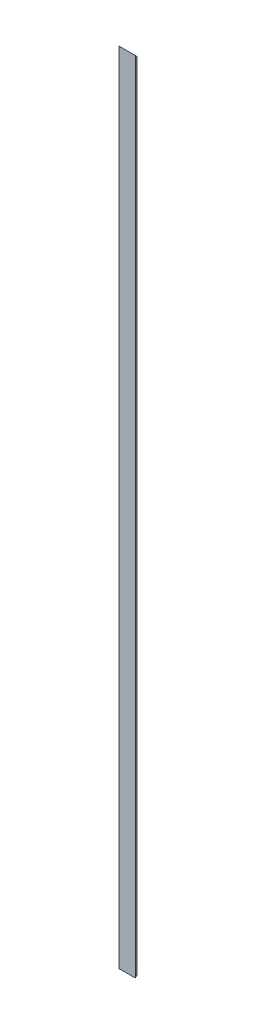
ISO-10303-21;
HEADER;
FILE_DESCRIPTION(('STEP AP214'),'2;1');
FILE_NAME('part.step','',(''),(''),'','','');
FILE_SCHEMA(('AUTOMOTIVE_DESIGN { 1 0 10303 214 1 1 1 1 }'));
ENDSEC;
DATA;
#1=APPLICATION_CONTEXT('core data for automotive mechanical design processes');
#2=APPLICATION_PROTOCOL_DEFINITION('international standard','automotive_design',2000,#1);
#3=PRODUCT_CONTEXT('',#1,'mechanical');
#4=PRODUCT('Part','Part','',(#3));
#5=PRODUCT_RELATED_PRODUCT_CATEGORY('part','',(#4));
#6=PRODUCT_DEFINITION_FORMATION('','',#4);
#7=PRODUCT_DEFINITION_CONTEXT('part definition',#1,'design');
#8=PRODUCT_DEFINITION('design','',#6,#7);
#9=PRODUCT_DEFINITION_SHAPE('','',#8);
#10=(LENGTH_UNIT() NAMED_UNIT(*) SI_UNIT(.MILLI.,.METRE.));
#11=(NAMED_UNIT(*) PLANE_ANGLE_UNIT() SI_UNIT($,.RADIAN.));
#12=(NAMED_UNIT(*) SI_UNIT($,.STERADIAN.) SOLID_ANGLE_UNIT());
#13=UNCERTAINTY_MEASURE_WITH_UNIT(LENGTH_MEASURE(1.E-05),#10,'distance_accuracy_value','');
#14=(GEOMETRIC_REPRESENTATION_CONTEXT(3) GLOBAL_UNCERTAINTY_ASSIGNED_CONTEXT((#13)) GLOBAL_UNIT_ASSIGNED_CONTEXT((#10,
#11,#12)) REPRESENTATION_CONTEXT('',''));
#15=CARTESIAN_POINT('',(0.,0.,0.));
#16=DIRECTION('',(0.,0.,1.));
#17=DIRECTION('',(1.,0.,0.));
#18=AXIS2_PLACEMENT_3D('',#15,#16,#17);
#19=CARTESIAN_POINT('',(0.,2200.,0.));
#20=DIRECTION('',(0.,0.,-1.));
#21=DIRECTION('',(-1.,0.,0.));
#22=AXIS2_PLACEMENT_3D('',#19,#20,#21);
#23=PLANE('',#22);
#24=DIRECTION('',(1.,0.,0.));
#25=VECTOR('',#24,1.);
#26=CARTESIAN_POINT('',(0.,0.,0.));
#27=LINE('',#26,#25);
#28=CARTESIAN_POINT('',(0.,0.,0.));
#29=VERTEX_POINT('',#28);
#30=CARTESIAN_POINT('',(45.,0.,0.));
#31=VERTEX_POINT('',#30);
#32=EDGE_CURVE('E97',#29,#31,#27,.T.);
#33=ORIENTED_EDGE('',*,*,#32,.T.);
#34=DIRECTION('',(0.,-1.,0.));
#35=VECTOR('',#34,1.);
#36=CARTESIAN_POINT('',(45.,2200.,0.));
#37=LINE('',#36,#35);
#38=CARTESIAN_POINT('',(45.,2200.,0.));
#39=VERTEX_POINT('',#38);
#40=EDGE_CURVE('E11',#39,#31,#37,.T.);
#41=ORIENTED_EDGE('',*,*,#40,.F.);
#42=DIRECTION('',(1.,0.,0.));
#43=VECTOR('',#42,1.);
#44=CARTESIAN_POINT('',(0.,2200.,0.));
#45=LINE('',#44,#43);
#46=CARTESIAN_POINT('',(0.,2200.,0.));
#47=VERTEX_POINT('',#46);
#48=EDGE_CURVE('E108',#47,#39,#45,.T.);
#49=ORIENTED_EDGE('',*,*,#48,.F.);
#50=DIRECTION('',(0.,-1.,0.));
#51=VECTOR('',#50,1.);
#52=CARTESIAN_POINT('',(0.,2200.,0.));
#53=LINE('',#52,#51);
#54=EDGE_CURVE('E114',#47,#29,#53,.T.);
#55=ORIENTED_EDGE('',*,*,#54,.T.);
#56=EDGE_LOOP('',(#33,#41,#49,#55));
#57=FACE_BOUND('',#56,.T.);
#58=ADVANCED_FACE('F38',(#57),#23,.F.);
#59=CARTESIAN_POINT('',(45.,2200.,-5.));
#60=DIRECTION('',(1.,0.,0.));
#61=DIRECTION('',(0.,0.,-1.));
#62=AXIS2_PLACEMENT_3D('',#59,#60,#61);
#63=PLANE('',#62);
#64=DIRECTION('',(0.,0.707106781186543,-0.707106781186552));
#65=VECTOR('',#64,1.);
#66=CARTESIAN_POINT('',(45.,0.,0.));
#67=LINE('',#66,#65);
#68=CARTESIAN_POINT('',(45.,4.99999999999999,-5.00000000000008));
#69=VERTEX_POINT('',#68);
#70=EDGE_CURVE('E103',#31,#69,#67,.T.);
#71=ORIENTED_EDGE('',*,*,#70,.T.);
#72=DIRECTION('',(0.,-1.,0.));
#73=VECTOR('',#72,1.);
#74=CARTESIAN_POINT('',(45.,2200.,-5.));
#75=LINE('',#74,#73);
#76=CARTESIAN_POINT('',(45.,2195.,-5.));
#77=VERTEX_POINT('',#76);
#78=EDGE_CURVE('E47',#77,#69,#75,.T.);
#79=ORIENTED_EDGE('',*,*,#78,.F.);
#80=DIRECTION('',(0.,0.707106781186543,0.707106781186552));
#81=VECTOR('',#80,1.);
#82=CARTESIAN_POINT('',(45.,2200.,0.));
#83=LINE('',#82,#81);
#84=EDGE_CURVE('E147',#77,#39,#83,.T.);
#85=ORIENTED_EDGE('',*,*,#84,.T.);
#86=ORIENTED_EDGE('',*,*,#40,.T.);
#87=EDGE_LOOP('',(#71,#79,#85,#86));
#88=FACE_BOUND('',#87,.T.);
#89=ADVANCED_FACE('F146',(#88),#63,.T.);
#90=CARTESIAN_POINT('',(0.,2200.,-5.));
#91=DIRECTION('',(0.,0.,-1.));
#92=DIRECTION('',(-1.,0.,0.));
#93=AXIS2_PLACEMENT_3D('',#90,#91,#92);
#94=PLANE('',#93);
#95=DIRECTION('',(1.,0.,0.));
#96=VECTOR('',#95,1.);
#97=CARTESIAN_POINT('',(0.,4.99999999999989,-5.));
#98=LINE('',#97,#96);
#99=CARTESIAN_POINT('',(5.,4.99999999999989,-4.99999999999989));
#100=VERTEX_POINT('',#99);
#101=EDGE_CURVE('E143',#100,#69,#98,.T.);
#102=ORIENTED_EDGE('',*,*,#101,.F.);
#103=DIRECTION('',(0.,-1.,0.));
#104=VECTOR('',#103,1.);
#105=CARTESIAN_POINT('',(5.,2200.,-5.));
#106=LINE('',#105,#104);
#107=CARTESIAN_POINT('',(5.,2195.,-5.));
#108=VERTEX_POINT('',#107);
#109=EDGE_CURVE('E132',#108,#100,#106,.T.);
#110=ORIENTED_EDGE('',*,*,#109,.F.);
#111=DIRECTION('',(-1.,0.,0.));
#112=VECTOR('',#111,1.);
#113=CARTESIAN_POINT('',(0.,2195.,-5.));
#114=LINE('',#113,#112);
#115=EDGE_CURVE('E109',#77,#108,#114,.T.);
#116=ORIENTED_EDGE('',*,*,#115,.F.);
#117=ORIENTED_EDGE('',*,*,#78,.T.);
#118=EDGE_LOOP('',(#102,#110,#116,#117));
#119=FACE_BOUND('',#118,.T.);
#120=ADVANCED_FACE('F141',(#119),#94,.T.);
#121=CARTESIAN_POINT('',(5.,2200.,-45.));
#122=DIRECTION('',(1.,0.,0.));
#123=DIRECTION('',(0.,0.,-1.));
#124=AXIS2_PLACEMENT_3D('',#121,#122,#123);
#125=PLANE('',#124);
#126=DIRECTION('',(0.,-0.707106781186544,0.707106781186552));
#127=VECTOR('',#126,1.);
#128=CARTESIAN_POINT('',(4.99999999999996,1122.49999999999,-1122.5));
#129=LINE('',#128,#127);
#130=CARTESIAN_POINT('',(5.00000000000001,44.9999999999995,-45.));
#131=VERTEX_POINT('',#130);
#132=EDGE_CURVE('E152',#131,#100,#129,.T.);
#133=ORIENTED_EDGE('',*,*,#132,.F.);
#134=DIRECTION('',(0.,-1.,0.));
#135=VECTOR('',#134,1.);
#136=CARTESIAN_POINT('',(5.,2200.,-45.));
#137=LINE('',#136,#135);
#138=CARTESIAN_POINT('',(5.00000000000001,2155.,-45.));
#139=VERTEX_POINT('',#138);
#140=EDGE_CURVE('E125',#139,#131,#137,.T.);
#141=ORIENTED_EDGE('',*,*,#140,.F.);
#142=DIRECTION('',(0.,-0.707106781186544,-0.707106781186552));
#143=VECTOR('',#142,1.);
#144=CARTESIAN_POINT('',(5.,2177.5,-22.5000000000003));
#145=LINE('',#144,#143);
#146=EDGE_CURVE('E165',#108,#139,#145,.T.);
#147=ORIENTED_EDGE('',*,*,#146,.F.);
#148=ORIENTED_EDGE('',*,*,#109,.T.);
#149=EDGE_LOOP('',(#133,#141,#147,#148));
#150=FACE_BOUND('',#149,.T.);
#151=ADVANCED_FACE('F175',(#150),#125,.T.);
#152=CARTESIAN_POINT('',(0.,2200.,-45.));
#153=DIRECTION('',(0.,0.,-1.));
#154=DIRECTION('',(-1.,0.,0.));
#155=AXIS2_PLACEMENT_3D('',#152,#153,#154);
#156=PLANE('',#155);
#157=DIRECTION('',(-1.,0.,0.));
#158=VECTOR('',#157,1.);
#159=CARTESIAN_POINT('',(45.,44.9999999999995,-45.));
#160=LINE('',#159,#158);
#161=CARTESIAN_POINT('',(0.,44.9999999999995,-45.));
#162=VERTEX_POINT('',#161);
#163=EDGE_CURVE('E149',#131,#162,#160,.T.);
#164=ORIENTED_EDGE('',*,*,#163,.T.);
#165=DIRECTION('',(0.,-1.,0.));
#166=VECTOR('',#165,1.);
#167=CARTESIAN_POINT('',(0.,2200.,-45.));
#168=LINE('',#167,#166);
#169=CARTESIAN_POINT('',(0.,2155.,-45.));
#170=VERTEX_POINT('',#169);
#171=EDGE_CURVE('E117',#170,#162,#168,.T.);
#172=ORIENTED_EDGE('',*,*,#171,.F.);
#173=DIRECTION('',(-1.,0.,0.));
#174=VECTOR('',#173,1.);
#175=CARTESIAN_POINT('',(45.,2155.,-45.));
#176=LINE('',#175,#174);
#177=EDGE_CURVE('E119',#139,#170,#176,.T.);
#178=ORIENTED_EDGE('',*,*,#177,.F.);
#179=ORIENTED_EDGE('',*,*,#140,.T.);
#180=EDGE_LOOP('',(#164,#172,#178,#179));
#181=FACE_BOUND('',#180,.T.);
#182=ADVANCED_FACE('F177',(#181),#156,.T.);
#183=CARTESIAN_POINT('',(0.,2200.,-45.));
#184=DIRECTION('',(1.,0.,0.));
#185=DIRECTION('',(0.,0.,-1.));
#186=AXIS2_PLACEMENT_3D('',#183,#184,#185);
#187=PLANE('',#186);
#188=ORIENTED_EDGE('',*,*,#171,.T.);
#189=DIRECTION('',(0.,0.707106781186543,-0.707106781186552));
#190=VECTOR('',#189,1.);
#191=CARTESIAN_POINT('',(0.,0.,0.));
#192=LINE('',#191,#190);
#193=EDGE_CURVE('E100',#29,#162,#192,.T.);
#194=ORIENTED_EDGE('',*,*,#193,.F.);
#195=ORIENTED_EDGE('',*,*,#54,.F.);
#196=DIRECTION('',(0.,0.707106781186543,0.707106781186552));
#197=VECTOR('',#196,1.);
#198=CARTESIAN_POINT('',(0.,2200.,0.));
#199=LINE('',#198,#197);
#200=EDGE_CURVE('E56',#170,#47,#199,.T.);
#201=ORIENTED_EDGE('',*,*,#200,.F.);
#202=EDGE_LOOP('',(#188,#194,#195,#201));
#203=FACE_BOUND('',#202,.T.);
#204=ADVANCED_FACE('F113',(#203),#187,.F.);
#205=CARTESIAN_POINT('',(45.,0.,0.));
#206=DIRECTION('',(0.,0.707106781186551,0.707106781186543));
#207=DIRECTION('',(0.,-0.707106781186544,0.707106781186552));
#208=AXIS2_PLACEMENT_3D('',#205,#206,#207);
#209=PLANE('',#208);
#210=ORIENTED_EDGE('',*,*,#101,.T.);
#211=ORIENTED_EDGE('',*,*,#70,.F.);
#212=ORIENTED_EDGE('',*,*,#32,.F.);
#213=ORIENTED_EDGE('',*,*,#193,.T.);
#214=ORIENTED_EDGE('',*,*,#163,.F.);
#215=ORIENTED_EDGE('',*,*,#132,.T.);
#216=EDGE_LOOP('',(#210,#211,#212,#213,#214,#215));
#217=FACE_BOUND('',#216,.T.);
#218=ADVANCED_FACE('F99',(#217),#209,.F.);
#219=CARTESIAN_POINT('',(45.,2200.,0.));
#220=DIRECTION('',(0.,-0.707106781186551,0.707106781186543));
#221=DIRECTION('',(0.,-0.707106781186544,-0.707106781186552));
#222=AXIS2_PLACEMENT_3D('',#219,#220,#221);
#223=PLANE('',#222);
#224=ORIENTED_EDGE('',*,*,#115,.T.);
#225=ORIENTED_EDGE('',*,*,#146,.T.);
#226=ORIENTED_EDGE('',*,*,#177,.T.);
#227=ORIENTED_EDGE('',*,*,#200,.T.);
#228=ORIENTED_EDGE('',*,*,#48,.T.);
#229=ORIENTED_EDGE('',*,*,#84,.F.);
#230=EDGE_LOOP('',(#224,#225,#226,#227,#228,#229));
#231=FACE_BOUND('',#230,.T.);
#232=ADVANCED_FACE('F170',(#231),#223,.F.);
#233=CLOSED_SHELL('',(#58,#89,#120,#151,#182,#204,#218,#232));
#234=MANIFOLD_SOLID_BREP('B2',#233);
#235=ADVANCED_BREP_SHAPE_REPRESENTATION('',(#18,#234),#14);
#236=SHAPE_DEFINITION_REPRESENTATION(#9,#235);
ENDSEC;
END-ISO-10303-21;
